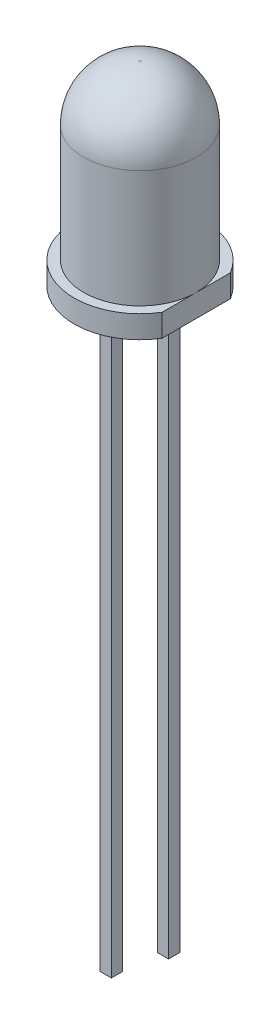
ISO-10303-21;
HEADER;
FILE_DESCRIPTION(('STEP AP214'),'2;1');
FILE_NAME('part.step','',(''),(''),'','','');
FILE_SCHEMA(('AUTOMOTIVE_DESIGN { 1 0 10303 214 1 1 1 1 }'));
ENDSEC;
DATA;
#1=APPLICATION_CONTEXT('core data for automotive mechanical design processes');
#2=APPLICATION_PROTOCOL_DEFINITION('international standard','automotive_design',2000,#1);
#3=PRODUCT_CONTEXT('',#1,'mechanical');
#4=PRODUCT('Part','Part','',(#3));
#5=PRODUCT_RELATED_PRODUCT_CATEGORY('part','',(#4));
#6=PRODUCT_DEFINITION_FORMATION('','',#4);
#7=PRODUCT_DEFINITION_CONTEXT('part definition',#1,'design');
#8=PRODUCT_DEFINITION('design','',#6,#7);
#9=PRODUCT_DEFINITION_SHAPE('','',#8);
#10=(LENGTH_UNIT() NAMED_UNIT(*) SI_UNIT(.MILLI.,.METRE.));
#11=(NAMED_UNIT(*) PLANE_ANGLE_UNIT() SI_UNIT($,.RADIAN.));
#12=(NAMED_UNIT(*) SI_UNIT($,.STERADIAN.) SOLID_ANGLE_UNIT());
#13=UNCERTAINTY_MEASURE_WITH_UNIT(LENGTH_MEASURE(1.E-05),#10,'distance_accuracy_value','');
#14=(GEOMETRIC_REPRESENTATION_CONTEXT(3) GLOBAL_UNCERTAINTY_ASSIGNED_CONTEXT((#13)) GLOBAL_UNIT_ASSIGNED_CONTEXT((#10,
#11,#12)) REPRESENTATION_CONTEXT('',''));
#15=CARTESIAN_POINT('',(0.,0.,0.));
#16=DIRECTION('',(0.,0.,1.));
#17=DIRECTION('',(1.,0.,0.));
#18=AXIS2_PLACEMENT_3D('',#15,#16,#17);
#19=CARTESIAN_POINT('',(1.02,-25.,-0.25));
#20=DIRECTION('',(0.,0.,1.));
#21=DIRECTION('',(1.,0.,0.));
#22=AXIS2_PLACEMENT_3D('',#19,#20,#21);
#23=PLANE('',#22);
#24=DIRECTION('',(1.,0.,0.));
#25=VECTOR('',#24,1.);
#26=CARTESIAN_POINT('',(1.02,-0.25,-0.25));
#27=LINE('',#26,#25);
#28=CARTESIAN_POINT('',(1.52,-0.25,-0.25));
#29=VERTEX_POINT('',#28);
#30=CARTESIAN_POINT('',(1.02,-0.25,-0.25));
#31=VERTEX_POINT('',#30);
#32=EDGE_CURVE('E144',#29,#31,#27,.F.);
#33=ORIENTED_EDGE('',*,*,#32,.F.);
#34=DIRECTION('',(0.,1.,0.));
#35=VECTOR('',#34,1.);
#36=CARTESIAN_POINT('',(1.52,-25.,-0.25));
#37=LINE('',#36,#35);
#38=CARTESIAN_POINT('',(1.52,-25.,-0.25));
#39=VERTEX_POINT('',#38);
#40=EDGE_CURVE('E199',#29,#39,#37,.F.);
#41=ORIENTED_EDGE('',*,*,#40,.T.);
#42=DIRECTION('',(1.,0.,0.));
#43=VECTOR('',#42,1.);
#44=CARTESIAN_POINT('',(0.,-25.,-0.25));
#45=LINE('',#44,#43);
#46=CARTESIAN_POINT('',(1.02,-25.,-0.25));
#47=VERTEX_POINT('',#46);
#48=EDGE_CURVE('E213',#47,#39,#45,.T.);
#49=ORIENTED_EDGE('',*,*,#48,.F.);
#50=DIRECTION('',(0.,1.,0.));
#51=VECTOR('',#50,1.);
#52=CARTESIAN_POINT('',(1.02,-25.,-0.25));
#53=LINE('',#52,#51);
#54=EDGE_CURVE('E209',#47,#31,#53,.T.);
#55=ORIENTED_EDGE('',*,*,#54,.T.);
#56=EDGE_LOOP('',(#33,#41,#49,#55));
#57=FACE_BOUND('',#56,.T.);
#58=ADVANCED_FACE('F18',(#57),#23,.F.);
#59=CARTESIAN_POINT('',(-1.52,-27.,0.25));
#60=DIRECTION('',(1.,0.,0.));
#61=DIRECTION('',(0.,0.,-1.));
#62=AXIS2_PLACEMENT_3D('',#59,#60,#61);
#63=PLANE('',#62);
#64=DIRECTION('',(0.,0.,-1.));
#65=VECTOR('',#64,1.);
#66=CARTESIAN_POINT('',(-1.52,-0.25,0.25));
#67=LINE('',#66,#65);
#68=CARTESIAN_POINT('',(-1.52,-0.25,-0.25));
#69=VERTEX_POINT('',#68);
#70=CARTESIAN_POINT('',(-1.52,-0.25,0.25));
#71=VERTEX_POINT('',#70);
#72=EDGE_CURVE('E216',#69,#71,#67,.F.);
#73=ORIENTED_EDGE('',*,*,#72,.F.);
#74=DIRECTION('',(0.,1.,0.));
#75=VECTOR('',#74,1.);
#76=CARTESIAN_POINT('',(-1.52,-27.,-0.25));
#77=LINE('',#76,#75);
#78=CARTESIAN_POINT('',(-1.52,-27.,-0.25));
#79=VERTEX_POINT('',#78);
#80=EDGE_CURVE('E180',#69,#79,#77,.F.);
#81=ORIENTED_EDGE('',*,*,#80,.T.);
#82=DIRECTION('',(0.,0.,-1.));
#83=VECTOR('',#82,1.);
#84=CARTESIAN_POINT('',(-1.52,-27.,0.));
#85=LINE('',#84,#83);
#86=CARTESIAN_POINT('',(-1.52,-27.,0.25));
#87=VERTEX_POINT('',#86);
#88=EDGE_CURVE('E194',#87,#79,#85,.T.);
#89=ORIENTED_EDGE('',*,*,#88,.F.);
#90=DIRECTION('',(0.,1.,0.));
#91=VECTOR('',#90,1.);
#92=CARTESIAN_POINT('',(-1.52,-27.,0.25));
#93=LINE('',#92,#91);
#94=EDGE_CURVE('E190',#87,#71,#93,.T.);
#95=ORIENTED_EDGE('',*,*,#94,.T.);
#96=EDGE_LOOP('',(#73,#81,#89,#95));
#97=FACE_BOUND('',#96,.T.);
#98=ADVANCED_FACE('F489',(#97),#63,.F.);
#99=CARTESIAN_POINT('',(0.,-25.,0.));
#100=DIRECTION('',(0.,-1.,0.));
#101=DIRECTION('',(0.,0.,-1.));
#102=AXIS2_PLACEMENT_3D('',#99,#100,#101);
#103=PLANE('',#102);
#104=DIRECTION('',(0.,0.,-1.));
#105=VECTOR('',#104,1.);
#106=CARTESIAN_POINT('',(1.02,-25.,0.25));
#107=LINE('',#106,#105);
#108=CARTESIAN_POINT('',(1.02,-25.,0.25));
#109=VERTEX_POINT('',#108);
#110=EDGE_CURVE('E210',#109,#47,#107,.T.);
#111=ORIENTED_EDGE('',*,*,#110,.T.);
#112=ORIENTED_EDGE('',*,*,#48,.T.);
#113=DIRECTION('',(0.,0.,1.));
#114=VECTOR('',#113,1.);
#115=CARTESIAN_POINT('',(1.52,-25.,0.25));
#116=LINE('',#115,#114);
#117=CARTESIAN_POINT('',(1.52,-25.,0.25));
#118=VERTEX_POINT('',#117);
#119=EDGE_CURVE('E200',#39,#118,#116,.T.);
#120=ORIENTED_EDGE('',*,*,#119,.T.);
#121=DIRECTION('',(-1.,0.,0.));
#122=VECTOR('',#121,1.);
#123=CARTESIAN_POINT('',(1.02,-25.,0.25));
#124=LINE('',#123,#122);
#125=EDGE_CURVE('E175',#118,#109,#124,.T.);
#126=ORIENTED_EDGE('',*,*,#125,.T.);
#127=EDGE_LOOP('',(#111,#112,#120,#126));
#128=FACE_BOUND('',#127,.T.);
#129=ADVANCED_FACE('F481',(#128),#103,.T.);
#130=CARTESIAN_POINT('',(1.02,-25.,0.25));
#131=DIRECTION('',(1.,0.,0.));
#132=DIRECTION('',(0.,0.,-1.));
#133=AXIS2_PLACEMENT_3D('',#130,#131,#132);
#134=PLANE('',#133);
#135=DIRECTION('',(0.,0.,-1.));
#136=VECTOR('',#135,1.);
#137=CARTESIAN_POINT('',(1.02,-0.25,0.25));
#138=LINE('',#137,#136);
#139=CARTESIAN_POINT('',(1.02,-0.25,0.25));
#140=VERTEX_POINT('',#139);
#141=EDGE_CURVE('E202',#31,#140,#138,.F.);
#142=ORIENTED_EDGE('',*,*,#141,.F.);
#143=ORIENTED_EDGE('',*,*,#54,.F.);
#144=ORIENTED_EDGE('',*,*,#110,.F.);
#145=DIRECTION('',(0.,1.,0.));
#146=VECTOR('',#145,1.);
#147=CARTESIAN_POINT('',(1.02,-25.,0.25));
#148=LINE('',#147,#146);
#149=EDGE_CURVE('E170',#109,#140,#148,.T.);
#150=ORIENTED_EDGE('',*,*,#149,.T.);
#151=EDGE_LOOP('',(#142,#143,#144,#150));
#152=FACE_BOUND('',#151,.T.);
#153=ADVANCED_FACE('F473',(#152),#134,.F.);
#154=CARTESIAN_POINT('',(1.52,-25.,0.25));
#155=DIRECTION('',(-1.,0.,0.));
#156=DIRECTION('',(0.,0.,1.));
#157=AXIS2_PLACEMENT_3D('',#154,#155,#156);
#158=PLANE('',#157);
#159=DIRECTION('',(0.,0.,1.));
#160=VECTOR('',#159,1.);
#161=CARTESIAN_POINT('',(1.52,-0.25,0.25));
#162=LINE('',#161,#160);
#163=CARTESIAN_POINT('',(1.52,-0.25,0.25));
#164=VERTEX_POINT('',#163);
#165=EDGE_CURVE('E197',#164,#29,#162,.F.);
#166=ORIENTED_EDGE('',*,*,#165,.F.);
#167=DIRECTION('',(0.,1.,0.));
#168=VECTOR('',#167,1.);
#169=CARTESIAN_POINT('',(1.52,-25.,0.25));
#170=LINE('',#169,#168);
#171=EDGE_CURVE('E167',#164,#118,#170,.F.);
#172=ORIENTED_EDGE('',*,*,#171,.T.);
#173=ORIENTED_EDGE('',*,*,#119,.F.);
#174=ORIENTED_EDGE('',*,*,#40,.F.);
#175=EDGE_LOOP('',(#166,#172,#173,#174));
#176=FACE_BOUND('',#175,.T.);
#177=ADVANCED_FACE('F465',(#176),#158,.F.);
#178=CARTESIAN_POINT('',(0.,-27.,0.));
#179=DIRECTION('',(0.,-1.,0.));
#180=DIRECTION('',(0.,0.,-1.));
#181=AXIS2_PLACEMENT_3D('',#178,#179,#180);
#182=PLANE('',#181);
#183=ORIENTED_EDGE('',*,*,#88,.T.);
#184=DIRECTION('',(1.,0.,0.));
#185=VECTOR('',#184,1.);
#186=CARTESIAN_POINT('',(-1.52,-27.,-0.25));
#187=LINE('',#186,#185);
#188=CARTESIAN_POINT('',(-1.02,-27.,-0.25));
#189=VERTEX_POINT('',#188);
#190=EDGE_CURVE('E181',#79,#189,#187,.T.);
#191=ORIENTED_EDGE('',*,*,#190,.T.);
#192=DIRECTION('',(0.,0.,1.));
#193=VECTOR('',#192,1.);
#194=CARTESIAN_POINT('',(-1.02,-27.,0.25));
#195=LINE('',#194,#193);
#196=CARTESIAN_POINT('',(-1.02,-27.,0.25));
#197=VERTEX_POINT('',#196);
#198=EDGE_CURVE('E164',#189,#197,#195,.T.);
#199=ORIENTED_EDGE('',*,*,#198,.T.);
#200=DIRECTION('',(-1.,0.,0.));
#201=VECTOR('',#200,1.);
#202=CARTESIAN_POINT('',(-1.52,-27.,0.25));
#203=LINE('',#202,#201);
#204=EDGE_CURVE('E191',#197,#87,#203,.T.);
#205=ORIENTED_EDGE('',*,*,#204,.T.);
#206=EDGE_LOOP('',(#183,#191,#199,#205));
#207=FACE_BOUND('',#206,.T.);
#208=ADVANCED_FACE('F457',(#207),#182,.T.);
#209=CARTESIAN_POINT('',(-1.52,-27.,0.25));
#210=DIRECTION('',(0.,0.,-1.));
#211=DIRECTION('',(-1.,0.,0.));
#212=AXIS2_PLACEMENT_3D('',#209,#210,#211);
#213=PLANE('',#212);
#214=DIRECTION('',(-1.,0.,0.));
#215=VECTOR('',#214,1.);
#216=CARTESIAN_POINT('',(-1.52,-0.25,0.25));
#217=LINE('',#216,#215);
#218=CARTESIAN_POINT('',(-1.02,-0.25,0.25));
#219=VERTEX_POINT('',#218);
#220=EDGE_CURVE('E183',#71,#219,#217,.F.);
#221=ORIENTED_EDGE('',*,*,#220,.F.);
#222=ORIENTED_EDGE('',*,*,#94,.F.);
#223=ORIENTED_EDGE('',*,*,#204,.F.);
#224=DIRECTION('',(0.,1.,0.));
#225=VECTOR('',#224,1.);
#226=CARTESIAN_POINT('',(-1.02,-27.,0.25));
#227=LINE('',#226,#225);
#228=EDGE_CURVE('E159',#197,#219,#227,.T.);
#229=ORIENTED_EDGE('',*,*,#228,.T.);
#230=EDGE_LOOP('',(#221,#222,#223,#229));
#231=FACE_BOUND('',#230,.T.);
#232=ADVANCED_FACE('F449',(#231),#213,.F.);
#233=CARTESIAN_POINT('',(-1.52,-27.,-0.25));
#234=DIRECTION('',(0.,0.,1.));
#235=DIRECTION('',(1.,0.,0.));
#236=AXIS2_PLACEMENT_3D('',#233,#234,#235);
#237=PLANE('',#236);
#238=DIRECTION('',(1.,0.,0.));
#239=VECTOR('',#238,1.);
#240=CARTESIAN_POINT('',(-1.52,-0.25,-0.25));
#241=LINE('',#240,#239);
#242=CARTESIAN_POINT('',(-1.02,-0.25,-0.25));
#243=VERTEX_POINT('',#242);
#244=EDGE_CURVE('E178',#243,#69,#241,.F.);
#245=ORIENTED_EDGE('',*,*,#244,.F.);
#246=DIRECTION('',(0.,1.,0.));
#247=VECTOR('',#246,1.);
#248=CARTESIAN_POINT('',(-1.02,-27.,-0.25));
#249=LINE('',#248,#247);
#250=EDGE_CURVE('E147',#243,#189,#249,.F.);
#251=ORIENTED_EDGE('',*,*,#250,.T.);
#252=ORIENTED_EDGE('',*,*,#190,.F.);
#253=ORIENTED_EDGE('',*,*,#80,.F.);
#254=EDGE_LOOP('',(#245,#251,#252,#253));
#255=FACE_BOUND('',#254,.T.);
#256=ADVANCED_FACE('F441',(#255),#237,.F.);
#257=CARTESIAN_POINT('',(1.02,-25.,0.25));
#258=DIRECTION('',(0.,0.,-1.));
#259=DIRECTION('',(-1.,0.,0.));
#260=AXIS2_PLACEMENT_3D('',#257,#258,#259);
#261=PLANE('',#260);
#262=DIRECTION('',(1.,0.,0.));
#263=VECTOR('',#262,1.);
#264=CARTESIAN_POINT('',(1.02,-0.25,0.25));
#265=LINE('',#264,#263);
#266=EDGE_CURVE('E265',#164,#140,#265,.F.);
#267=ORIENTED_EDGE('',*,*,#266,.T.);
#268=ORIENTED_EDGE('',*,*,#149,.F.);
#269=ORIENTED_EDGE('',*,*,#125,.F.);
#270=ORIENTED_EDGE('',*,*,#171,.F.);
#271=EDGE_LOOP('',(#267,#268,#269,#270));
#272=FACE_BOUND('',#271,.T.);
#273=ADVANCED_FACE('F433',(#272),#261,.F.);
#274=CARTESIAN_POINT('',(-1.02,-27.,0.25));
#275=DIRECTION('',(-1.,0.,0.));
#276=DIRECTION('',(0.,0.,1.));
#277=AXIS2_PLACEMENT_3D('',#274,#275,#276);
#278=PLANE('',#277);
#279=DIRECTION('',(0.,0.,-1.));
#280=VECTOR('',#279,1.);
#281=CARTESIAN_POINT('',(-1.02,-0.25,0.25));
#282=LINE('',#281,#280);
#283=EDGE_CURVE('E254',#243,#219,#282,.F.);
#284=ORIENTED_EDGE('',*,*,#283,.T.);
#285=ORIENTED_EDGE('',*,*,#228,.F.);
#286=ORIENTED_EDGE('',*,*,#198,.F.);
#287=ORIENTED_EDGE('',*,*,#250,.F.);
#288=EDGE_LOOP('',(#284,#285,#286,#287));
#289=FACE_BOUND('',#288,.T.);
#290=ADVANCED_FACE('F426',(#289),#278,.F.);
#291=CARTESIAN_POINT('',(0.77,-0.25,0.25));
#292=DIRECTION('',(0.,0.,1.));
#293=DIRECTION('',(1.,0.,0.));
#294=AXIS2_PLACEMENT_3D('',#291,#292,#293);
#295=CYLINDRICAL_SURFACE('',#294,0.25);
#296=DIRECTION('',(0.,0.,1.));
#297=VECTOR('',#296,1.);
#298=CARTESIAN_POINT('',(0.77,0.,0.));
#299=LINE('',#298,#297);
#300=CARTESIAN_POINT('',(0.77,0.,0.5));
#301=VERTEX_POINT('',#300);
#302=CARTESIAN_POINT('',(0.77,0.,-0.5));
#303=VERTEX_POINT('',#302);
#304=EDGE_CURVE('E124',#301,#303,#299,.F.);
#305=ORIENTED_EDGE('',*,*,#304,.T.);
#306=CARTESIAN_POINT('',(0.77,-0.25,-0.5));
#307=DIRECTION('',(-0.707106781186547,0.,0.707106781186547));
#308=DIRECTION('',(0.707106781186547,0.,0.707106781186547));
#309=AXIS2_PLACEMENT_3D('',#306,#307,#308);
#310=ELLIPSE('',#309,0.353553390593274,0.25);
#311=EDGE_CURVE('E127',#303,#31,#310,.F.);
#312=ORIENTED_EDGE('',*,*,#311,.T.);
#313=ORIENTED_EDGE('',*,*,#141,.T.);
#314=CARTESIAN_POINT('',(0.77,-0.25,0.5));
#315=DIRECTION('',(0.707106781186547,0.,0.707106781186547));
#316=DIRECTION('',(-0.707106781186547,0.,0.707106781186547));
#317=AXIS2_PLACEMENT_3D('',#314,#315,#316);
#318=ELLIPSE('',#317,0.353553390593274,0.25);
#319=EDGE_CURVE('E130',#140,#301,#318,.T.);
#320=ORIENTED_EDGE('',*,*,#319,.T.);
#321=EDGE_LOOP('',(#305,#312,#313,#320));
#322=FACE_BOUND('',#321,.T.);
#323=ADVANCED_FACE('F126',(#322),#295,.F.);
#324=CARTESIAN_POINT('',(1.02,-0.25,-0.5));
#325=DIRECTION('',(-1.,0.,0.));
#326=DIRECTION('',(0.,0.,1.));
#327=AXIS2_PLACEMENT_3D('',#324,#325,#326);
#328=CYLINDRICAL_SURFACE('',#327,0.25);
#329=DIRECTION('',(1.,0.,0.));
#330=VECTOR('',#329,1.);
#331=CARTESIAN_POINT('',(0.,0.,-0.5));
#332=LINE('',#331,#330);
#333=CARTESIAN_POINT('',(1.77,0.,-0.5));
#334=VERTEX_POINT('',#333);
#335=EDGE_CURVE('E135',#303,#334,#332,.T.);
#336=ORIENTED_EDGE('',*,*,#335,.T.);
#337=CARTESIAN_POINT('',(1.77,-0.25,-0.5));
#338=DIRECTION('',(-0.707106781186547,0.,-0.707106781186547));
#339=DIRECTION('',(-0.707106781186547,0.,0.707106781186547));
#340=AXIS2_PLACEMENT_3D('',#337,#338,#339);
#341=ELLIPSE('',#340,0.353553390593274,0.25);
#342=EDGE_CURVE('E146',#334,#29,#341,.F.);
#343=ORIENTED_EDGE('',*,*,#342,.T.);
#344=ORIENTED_EDGE('',*,*,#32,.T.);
#345=ORIENTED_EDGE('',*,*,#311,.F.);
#346=EDGE_LOOP('',(#336,#343,#344,#345));
#347=FACE_BOUND('',#346,.T.);
#348=ADVANCED_FACE('F140',(#347),#328,.F.);
#349=CARTESIAN_POINT('',(1.77,-0.25,0.25));
#350=DIRECTION('',(0.,0.,-1.));
#351=DIRECTION('',(-1.,0.,0.));
#352=AXIS2_PLACEMENT_3D('',#349,#350,#351);
#353=CYLINDRICAL_SURFACE('',#352,0.25);
#354=DIRECTION('',(0.,0.,1.));
#355=VECTOR('',#354,1.);
#356=CARTESIAN_POINT('',(1.77,0.,0.));
#357=LINE('',#356,#355);
#358=CARTESIAN_POINT('',(1.77,0.,0.5));
#359=VERTEX_POINT('',#358);
#360=EDGE_CURVE('E151',#334,#359,#357,.T.);
#361=ORIENTED_EDGE('',*,*,#360,.T.);
#362=CARTESIAN_POINT('',(1.77,-0.25,0.5));
#363=DIRECTION('',(0.707106781186547,0.,-0.707106781186547));
#364=DIRECTION('',(-0.707106781186547,0.,-0.707106781186547));
#365=AXIS2_PLACEMENT_3D('',#362,#363,#364);
#366=ELLIPSE('',#365,0.353553390593274,0.25);
#367=EDGE_CURVE('E266',#359,#164,#366,.F.);
#368=ORIENTED_EDGE('',*,*,#367,.T.);
#369=ORIENTED_EDGE('',*,*,#165,.T.);
#370=ORIENTED_EDGE('',*,*,#342,.F.);
#371=EDGE_LOOP('',(#361,#368,#369,#370));
#372=FACE_BOUND('',#371,.T.);
#373=ADVANCED_FACE('F405',(#372),#353,.F.);
#374=CARTESIAN_POINT('',(1.02,-0.25,0.5));
#375=DIRECTION('',(1.,0.,0.));
#376=DIRECTION('',(0.,0.,-1.));
#377=AXIS2_PLACEMENT_3D('',#374,#375,#376);
#378=CYLINDRICAL_SURFACE('',#377,0.25);
#379=ORIENTED_EDGE('',*,*,#266,.F.);
#380=ORIENTED_EDGE('',*,*,#367,.F.);
#381=DIRECTION('',(1.,0.,0.));
#382=VECTOR('',#381,1.);
#383=CARTESIAN_POINT('',(0.,0.,0.5));
#384=LINE('',#383,#382);
#385=EDGE_CURVE('E153',#359,#301,#384,.F.);
#386=ORIENTED_EDGE('',*,*,#385,.T.);
#387=ORIENTED_EDGE('',*,*,#319,.F.);
#388=EDGE_LOOP('',(#379,#380,#386,#387));
#389=FACE_BOUND('',#388,.T.);
#390=ADVANCED_FACE('F397',(#389),#378,.F.);
#391=CARTESIAN_POINT('',(-1.52,-0.25,0.5));
#392=DIRECTION('',(1.,0.,0.));
#393=DIRECTION('',(0.,0.,-1.));
#394=AXIS2_PLACEMENT_3D('',#391,#392,#393);
#395=CYLINDRICAL_SURFACE('',#394,0.25);
#396=DIRECTION('',(1.,0.,0.));
#397=VECTOR('',#396,1.);
#398=CARTESIAN_POINT('',(0.,0.,0.5));
#399=LINE('',#398,#397);
#400=CARTESIAN_POINT('',(-0.77,0.,0.5));
#401=VERTEX_POINT('',#400);
#402=CARTESIAN_POINT('',(-1.77,0.,0.5));
#403=VERTEX_POINT('',#402);
#404=EDGE_CURVE('E580',#401,#403,#399,.F.);
#405=ORIENTED_EDGE('',*,*,#404,.T.);
#406=CARTESIAN_POINT('',(-1.77,-0.25,0.5));
#407=DIRECTION('',(0.707106781186547,0.,0.707106781186547));
#408=DIRECTION('',(0.707106781186547,0.,-0.707106781186547));
#409=AXIS2_PLACEMENT_3D('',#406,#407,#408);
#410=ELLIPSE('',#409,0.353553390593274,0.25);
#411=EDGE_CURVE('E261',#403,#71,#410,.F.);
#412=ORIENTED_EDGE('',*,*,#411,.T.);
#413=ORIENTED_EDGE('',*,*,#220,.T.);
#414=CARTESIAN_POINT('',(-0.77,-0.25,0.5));
#415=DIRECTION('',(0.707106781186547,0.,-0.707106781186547));
#416=DIRECTION('',(0.707106781186547,0.,0.707106781186547));
#417=AXIS2_PLACEMENT_3D('',#414,#415,#416);
#418=ELLIPSE('',#417,0.353553390593274,0.25);
#419=EDGE_CURVE('E251',#219,#401,#418,.T.);
#420=ORIENTED_EDGE('',*,*,#419,.T.);
#421=EDGE_LOOP('',(#405,#412,#413,#420));
#422=FACE_BOUND('',#421,.T.);
#423=ADVANCED_FACE('F389',(#422),#395,.F.);
#424=CARTESIAN_POINT('',(-1.77,-0.25,0.25));
#425=DIRECTION('',(0.,0.,1.));
#426=DIRECTION('',(1.,0.,0.));
#427=AXIS2_PLACEMENT_3D('',#424,#425,#426);
#428=CYLINDRICAL_SURFACE('',#427,0.25);
#429=DIRECTION('',(0.,0.,1.));
#430=VECTOR('',#429,1.);
#431=CARTESIAN_POINT('',(-1.77,0.,0.));
#432=LINE('',#431,#430);
#433=CARTESIAN_POINT('',(-1.77,0.,-0.5));
#434=VERTEX_POINT('',#433);
#435=EDGE_CURVE('E581',#403,#434,#432,.F.);
#436=ORIENTED_EDGE('',*,*,#435,.T.);
#437=CARTESIAN_POINT('',(-1.77,-0.25,-0.5));
#438=DIRECTION('',(-0.707106781186547,0.,0.707106781186547));
#439=DIRECTION('',(0.707106781186547,0.,0.707106781186547));
#440=AXIS2_PLACEMENT_3D('',#437,#438,#439);
#441=ELLIPSE('',#440,0.353553390593274,0.25);
#442=EDGE_CURVE('E258',#434,#69,#441,.F.);
#443=ORIENTED_EDGE('',*,*,#442,.T.);
#444=ORIENTED_EDGE('',*,*,#72,.T.);
#445=ORIENTED_EDGE('',*,*,#411,.F.);
#446=EDGE_LOOP('',(#436,#443,#444,#445));
#447=FACE_BOUND('',#446,.T.);
#448=ADVANCED_FACE('F381',(#447),#428,.F.);
#449=CARTESIAN_POINT('',(-1.52,-0.25,-0.5));
#450=DIRECTION('',(-1.,0.,0.));
#451=DIRECTION('',(0.,0.,1.));
#452=AXIS2_PLACEMENT_3D('',#449,#450,#451);
#453=CYLINDRICAL_SURFACE('',#452,0.25);
#454=DIRECTION('',(1.,0.,0.));
#455=VECTOR('',#454,1.);
#456=CARTESIAN_POINT('',(0.,0.,-0.5));
#457=LINE('',#456,#455);
#458=CARTESIAN_POINT('',(-0.77,0.,-0.5));
#459=VERTEX_POINT('',#458);
#460=EDGE_CURVE('E584',#434,#459,#457,.T.);
#461=ORIENTED_EDGE('',*,*,#460,.T.);
#462=CARTESIAN_POINT('',(-0.77,-0.25,-0.5));
#463=DIRECTION('',(-0.707106781186547,0.,-0.707106781186547));
#464=DIRECTION('',(-0.707106781186547,0.,0.707106781186547));
#465=AXIS2_PLACEMENT_3D('',#462,#463,#464);
#466=ELLIPSE('',#465,0.353553390593274,0.25);
#467=EDGE_CURVE('E255',#459,#243,#466,.F.);
#468=ORIENTED_EDGE('',*,*,#467,.T.);
#469=ORIENTED_EDGE('',*,*,#244,.T.);
#470=ORIENTED_EDGE('',*,*,#442,.F.);
#471=EDGE_LOOP('',(#461,#468,#469,#470));
#472=FACE_BOUND('',#471,.T.);
#473=ADVANCED_FACE('F373',(#472),#453,.F.);
#474=CARTESIAN_POINT('',(-0.77,-0.25,0.25));
#475=DIRECTION('',(0.,0.,-1.));
#476=DIRECTION('',(-1.,0.,0.));
#477=AXIS2_PLACEMENT_3D('',#474,#475,#476);
#478=CYLINDRICAL_SURFACE('',#477,0.25);
#479=ORIENTED_EDGE('',*,*,#283,.F.);
#480=ORIENTED_EDGE('',*,*,#467,.F.);
#481=DIRECTION('',(0.,0.,1.));
#482=VECTOR('',#481,1.);
#483=CARTESIAN_POINT('',(-0.77,0.,0.));
#484=LINE('',#483,#482);
#485=EDGE_CURVE('E586',#459,#401,#484,.T.);
#486=ORIENTED_EDGE('',*,*,#485,.T.);
#487=ORIENTED_EDGE('',*,*,#419,.F.);
#488=EDGE_LOOP('',(#479,#480,#486,#487));
#489=FACE_BOUND('',#488,.T.);
#490=ADVANCED_FACE('F366',(#489),#478,.F.);
#491=CARTESIAN_POINT('',(2.5,8.65,-1.78815321583182));
#492=DIRECTION('',(-1.,0.,0.));
#493=DIRECTION('',(0.,0.,1.));
#494=AXIS2_PLACEMENT_3D('',#491,#492,#493);
#495=PLANE('',#494);
#496=DIRECTION('',(0.,0.,1.));
#497=VECTOR('',#496,1.);
#498=CARTESIAN_POINT('',(2.5,1.,0.));
#499=LINE('',#498,#497);
#500=CARTESIAN_POINT('',(2.5,1.,1.51842846390601));
#501=VERTEX_POINT('',#500);
#502=CARTESIAN_POINT('',(2.5,1.,-1.51842846390601));
#503=VERTEX_POINT('',#502);
#504=EDGE_CURVE('E136',#501,#503,#499,.F.);
#505=ORIENTED_EDGE('',*,*,#504,.F.);
#506=DIRECTION('',(0.,1.,0.));
#507=VECTOR('',#506,1.);
#508=CARTESIAN_POINT('',(2.5,8.65,1.51842846390601));
#509=LINE('',#508,#507);
#510=CARTESIAN_POINT('',(2.5,0.,1.51842846390601));
#511=VERTEX_POINT('',#510);
#512=EDGE_CURVE('E250',#511,#501,#509,.T.);
#513=ORIENTED_EDGE('',*,*,#512,.F.);
#514=DIRECTION('',(0.,0.,1.));
#515=VECTOR('',#514,1.);
#516=CARTESIAN_POINT('',(2.5,0.,0.));
#517=LINE('',#516,#515);
#518=CARTESIAN_POINT('',(2.5,0.,-1.51842846390601));
#519=VERTEX_POINT('',#518);
#520=EDGE_CURVE('E247',#511,#519,#517,.F.);
#521=ORIENTED_EDGE('',*,*,#520,.T.);
#522=DIRECTION('',(0.,1.,0.));
#523=VECTOR('',#522,1.);
#524=CARTESIAN_POINT('',(2.5,8.65,-1.51842846390601));
#525=LINE('',#524,#523);
#526=EDGE_CURVE('E253',#503,#519,#525,.F.);
#527=ORIENTED_EDGE('',*,*,#526,.F.);
#528=EDGE_LOOP('',(#505,#513,#521,#527));
#529=FACE_BOUND('',#528,.T.);
#530=ADVANCED_FACE('F359',(#529),#495,.F.);
#531=CARTESIAN_POINT('',(0.,0.,0.));
#532=DIRECTION('',(0.,1.,0.));
#533=DIRECTION('',(0.,0.,1.));
#534=AXIS2_PLACEMENT_3D('',#531,#532,#533);
#535=PLANE('',#534);
#536=ORIENTED_EDGE('',*,*,#520,.F.);
#537=CARTESIAN_POINT('',(0.,0.,0.));
#538=DIRECTION('',(0.,-1.,0.));
#539=DIRECTION('',(0.,0.,-1.));
#540=AXIS2_PLACEMENT_3D('',#537,#538,#539);
#541=CIRCLE('',#540,2.925);
#542=EDGE_CURVE('E244',#519,#511,#541,.F.);
#543=ORIENTED_EDGE('',*,*,#542,.F.);
#544=EDGE_LOOP('',(#536,#543));
#545=FACE_BOUND('',#544,.T.);
#546=ORIENTED_EDGE('',*,*,#460,.F.);
#547=ORIENTED_EDGE('',*,*,#435,.F.);
#548=ORIENTED_EDGE('',*,*,#404,.F.);
#549=ORIENTED_EDGE('',*,*,#485,.F.);
#550=EDGE_LOOP('',(#546,#547,#548,#549));
#551=FACE_BOUND('',#550,.T.);
#552=ORIENTED_EDGE('',*,*,#360,.F.);
#553=ORIENTED_EDGE('',*,*,#335,.F.);
#554=ORIENTED_EDGE('',*,*,#304,.F.);
#555=ORIENTED_EDGE('',*,*,#385,.F.);
#556=EDGE_LOOP('',(#552,#553,#554,#555));
#557=FACE_BOUND('',#556,.T.);
#558=ADVANCED_FACE('F150',(#545,#551,#557),#535,.F.);
#559=CARTESIAN_POINT('',(0.,8.65,0.));
#560=DIRECTION('',(0.,1.,0.));
#561=DIRECTION('',(0.,0.,1.));
#562=AXIS2_PLACEMENT_3D('',#559,#560,#561);
#563=PLANE('',#562);
#564=CARTESIAN_POINT('',(0.,8.65,0.));
#565=DIRECTION('',(0.,-1.,0.));
#566=DIRECTION('',(0.,0.,-1.));
#567=AXIS2_PLACEMENT_3D('',#564,#565,#566);
#568=CIRCLE('',#567,0.0499999999999998);
#569=CARTESIAN_POINT('',(0.,8.65,-0.0499999999999995));
#570=VERTEX_POINT('',#569);
#571=CARTESIAN_POINT('',(0.,8.65,0.0499999999999995));
#572=VERTEX_POINT('',#571);
#573=EDGE_CURVE('E243',#570,#572,#568,.T.);
#574=ORIENTED_EDGE('',*,*,#573,.F.);
#575=CARTESIAN_POINT('',(0.,8.65,0.));
#576=DIRECTION('',(0.,-1.,0.));
#577=DIRECTION('',(0.,0.,1.));
#578=AXIS2_PLACEMENT_3D('',#575,#576,#577);
#579=CIRCLE('',#578,0.0499999999999998);
#580=EDGE_CURVE('E37',#572,#570,#579,.T.);
#581=ORIENTED_EDGE('',*,*,#580,.F.);
#582=EDGE_LOOP('',(#574,#581));
#583=FACE_BOUND('',#582,.T.);
#584=ADVANCED_FACE('F274',(#583),#563,.T.);
#585=CARTESIAN_POINT('',(0.,1.,0.));
#586=DIRECTION('',(0.,-1.,0.));
#587=DIRECTION('',(0.,0.,-1.));
#588=AXIS2_PLACEMENT_3D('',#585,#586,#587);
#589=CYLINDRICAL_SURFACE('',#588,2.925);
#590=ORIENTED_EDGE('',*,*,#542,.T.);
#591=ORIENTED_EDGE('',*,*,#512,.T.);
#592=CARTESIAN_POINT('',(0.,1.,0.));
#593=DIRECTION('',(0.,-1.,0.));
#594=DIRECTION('',(0.,0.,-1.));
#595=AXIS2_PLACEMENT_3D('',#592,#593,#594);
#596=CIRCLE('',#595,2.925);
#597=EDGE_CURVE('E240',#503,#501,#596,.F.);
#598=ORIENTED_EDGE('',*,*,#597,.F.);
#599=ORIENTED_EDGE('',*,*,#526,.T.);
#600=EDGE_LOOP('',(#590,#591,#598,#599));
#601=FACE_BOUND('',#600,.T.);
#602=ADVANCED_FACE('F292',(#601),#589,.T.);
#603=CARTESIAN_POINT('',(0.,6.2,0.0499999999999997));
#604=DIRECTION('',(1.,0.,0.));
#605=DIRECTION('',(0.,0.,1.));
#606=AXIS2_PLACEMENT_3D('',#603,#604,#605);
#607=CIRCLE('',#606,2.45);
#608=TRIMMED_CURVE('',#607,(PARAMETER_VALUE(-1.59120590696907)),
(PARAMETER_VALUE(1.59120590696907)),.T.,.PARAMETER.);
#609=CARTESIAN_POINT('',(0.,6.2,0.));
#610=DIRECTION('',(0.,1.,0.));
#611=AXIS1_PLACEMENT('',#609,#610);
#612=SURFACE_OF_REVOLUTION('',#608,#611);
#613=ORIENTED_EDGE('',*,*,#580,.T.);
#614=ORIENTED_EDGE('',*,*,#573,.T.);
#615=EDGE_LOOP('',(#613,#614));
#616=FACE_BOUND('',#615,.T.);
#617=CARTESIAN_POINT('',(0.,6.2,0.));
#618=DIRECTION('',(0.,-1.,0.));
#619=DIRECTION('',(0.,0.,-1.));
#620=AXIS2_PLACEMENT_3D('',#617,#618,#619);
#621=CIRCLE('',#620,2.5);
#622=CARTESIAN_POINT('',(0.,6.2,-2.5));
#623=VERTEX_POINT('',#622);
#624=EDGE_CURVE('E29',#623,#623,#621,.T.);
#625=ORIENTED_EDGE('',*,*,#624,.F.);
#626=EDGE_LOOP('',(#625));
#627=FACE_BOUND('',#626,.T.);
#628=ADVANCED_FACE('F270',(#616,#627),#612,.F.);
#629=CARTESIAN_POINT('',(0.,1.,0.));
#630=DIRECTION('',(0.,1.,0.));
#631=DIRECTION('',(0.,0.,1.));
#632=AXIS2_PLACEMENT_3D('',#629,#630,#631);
#633=PLANE('',#632);
#634=ORIENTED_EDGE('',*,*,#597,.T.);
#635=ORIENTED_EDGE('',*,*,#504,.T.);
#636=EDGE_LOOP('',(#634,#635));
#637=FACE_BOUND('',#636,.T.);
#638=CARTESIAN_POINT('',(0.,1.,0.));
#639=DIRECTION('',(0.,-1.,0.));
#640=DIRECTION('',(0.,0.,-1.));
#641=AXIS2_PLACEMENT_3D('',#638,#639,#640);
#642=CIRCLE('',#641,2.5);
#643=CARTESIAN_POINT('',(0.,1.,-2.5));
#644=VERTEX_POINT('',#643);
#645=EDGE_CURVE('E11',#644,#644,#642,.F.);
#646=ORIENTED_EDGE('',*,*,#645,.F.);
#647=EDGE_LOOP('',(#646));
#648=FACE_BOUND('',#647,.T.);
#649=ADVANCED_FACE('F315',(#637,#648),#633,.T.);
#650=CARTESIAN_POINT('',(0.,8.65,0.));
#651=DIRECTION('',(0.,-1.,0.));
#652=DIRECTION('',(0.,0.,-1.));
#653=AXIS2_PLACEMENT_3D('',#650,#651,#652);
#654=CYLINDRICAL_SURFACE('',#653,2.5);
#655=ORIENTED_EDGE('',*,*,#645,.T.);
#656=EDGE_LOOP('',(#655));
#657=FACE_BOUND('',#656,.T.);
#658=ORIENTED_EDGE('',*,*,#624,.T.);
#659=EDGE_LOOP('',(#658));
#660=FACE_BOUND('',#659,.T.);
#661=ADVANCED_FACE('F319',(#657,#660),#654,.T.);
#662=CLOSED_SHELL('',(#58,#98,#129,#153,#177,#208,#232,#256,#273,#290,#323,#348,#373,#390,#423,
#448,#473,#490,#530,#558,#584,#602,#628,#649,#661));
#663=MANIFOLD_SOLID_BREP('B1',#662);
#664=ADVANCED_BREP_SHAPE_REPRESENTATION('',(#18,#663),#14);
#665=SHAPE_DEFINITION_REPRESENTATION(#9,#664);
ENDSEC;
END-ISO-10303-21;
